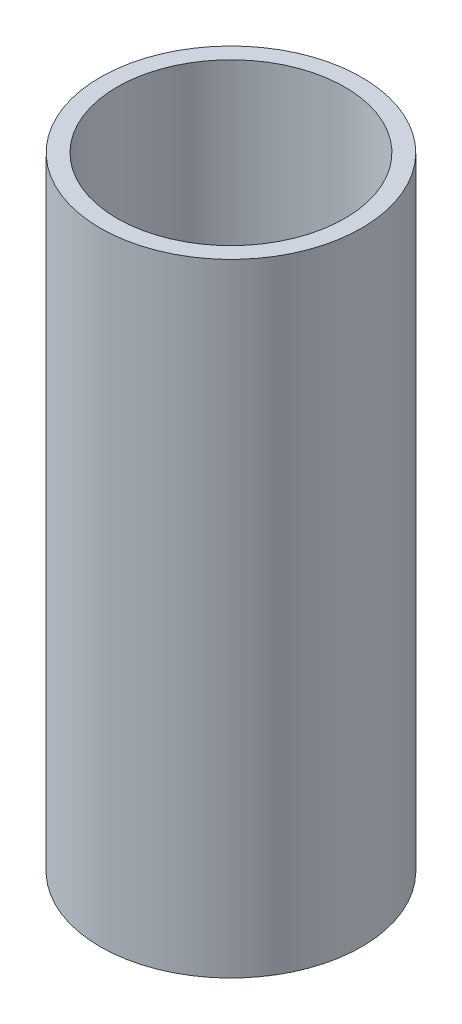
ISO-10303-21;
HEADER;
FILE_DESCRIPTION(('STEP AP214'),'2;1');
FILE_NAME('part.step','',(''),(''),'','','');
FILE_SCHEMA(('AUTOMOTIVE_DESIGN { 1 0 10303 214 1 1 1 1 }'));
ENDSEC;
DATA;
#1=APPLICATION_CONTEXT('core data for automotive mechanical design processes');
#2=APPLICATION_PROTOCOL_DEFINITION('international standard','automotive_design',2000,#1);
#3=PRODUCT_CONTEXT('',#1,'mechanical');
#4=PRODUCT('Part','Part','',(#3));
#5=PRODUCT_RELATED_PRODUCT_CATEGORY('part','',(#4));
#6=PRODUCT_DEFINITION_FORMATION('','',#4);
#7=PRODUCT_DEFINITION_CONTEXT('part definition',#1,'design');
#8=PRODUCT_DEFINITION('design','',#6,#7);
#9=PRODUCT_DEFINITION_SHAPE('','',#8);
#10=(LENGTH_UNIT() NAMED_UNIT(*) SI_UNIT(.MILLI.,.METRE.));
#11=(NAMED_UNIT(*) PLANE_ANGLE_UNIT() SI_UNIT($,.RADIAN.));
#12=(NAMED_UNIT(*) SI_UNIT($,.STERADIAN.) SOLID_ANGLE_UNIT());
#13=UNCERTAINTY_MEASURE_WITH_UNIT(LENGTH_MEASURE(1.E-05),#10,'distance_accuracy_value','');
#14=(GEOMETRIC_REPRESENTATION_CONTEXT(3) GLOBAL_UNCERTAINTY_ASSIGNED_CONTEXT((#13)) GLOBAL_UNIT_ASSIGNED_CONTEXT((#10,
#11,#12)) REPRESENTATION_CONTEXT('',''));
#15=CARTESIAN_POINT('',(0.,0.,0.));
#16=DIRECTION('',(0.,0.,1.));
#17=DIRECTION('',(1.,0.,0.));
#18=AXIS2_PLACEMENT_3D('',#15,#16,#17);
#19=CARTESIAN_POINT('',(0.,50.,0.));
#20=DIRECTION('',(0.,1.,0.));
#21=DIRECTION('',(0.,0.,1.));
#22=AXIS2_PLACEMENT_3D('',#19,#20,#21);
#23=PLANE('',#22);
#24=CARTESIAN_POINT('',(0.,50.,0.));
#25=DIRECTION('',(0.,1.,0.));
#26=DIRECTION('',(0.,0.,1.));
#27=AXIS2_PLACEMENT_3D('',#24,#25,#26);
#28=CIRCLE('',#27,10.5);
#29=CARTESIAN_POINT('',(0.,50.,10.5));
#30=VERTEX_POINT('',#29);
#31=EDGE_CURVE('E10',#30,#30,#28,.T.);
#32=ORIENTED_EDGE('',*,*,#31,.T.);
#33=EDGE_LOOP('',(#32));
#34=FACE_BOUND('',#33,.T.);
#35=CARTESIAN_POINT('',(0.,50.,0.));
#36=DIRECTION('',(0.,1.,0.));
#37=DIRECTION('',(0.,0.,1.));
#38=AXIS2_PLACEMENT_3D('',#35,#36,#37);
#39=CIRCLE('',#38,9.14661004148478);
#40=CARTESIAN_POINT('',(0.,50.,9.14661004148478));
#41=VERTEX_POINT('',#40);
#42=EDGE_CURVE('E50',#41,#41,#39,.T.);
#43=ORIENTED_EDGE('',*,*,#42,.F.);
#44=EDGE_LOOP('',(#43));
#45=FACE_BOUND('',#44,.T.);
#46=ADVANCED_FACE('F37',(#34,#45),#23,.T.);
#47=CARTESIAN_POINT('',(0.,0.,0.));
#48=DIRECTION('',(0.,1.,0.));
#49=DIRECTION('',(0.,0.,1.));
#50=AXIS2_PLACEMENT_3D('',#47,#48,#49);
#51=PLANE('',#50);
#52=CARTESIAN_POINT('',(0.,0.,0.));
#53=DIRECTION('',(0.,1.,0.));
#54=DIRECTION('',(0.,0.,1.));
#55=AXIS2_PLACEMENT_3D('',#52,#53,#54);
#56=CIRCLE('',#55,10.5);
#57=CARTESIAN_POINT('',(0.,0.,10.5));
#58=VERTEX_POINT('',#57);
#59=EDGE_CURVE('E41',#58,#58,#56,.T.);
#60=ORIENTED_EDGE('',*,*,#59,.F.);
#61=EDGE_LOOP('',(#60));
#62=FACE_BOUND('',#61,.T.);
#63=CARTESIAN_POINT('',(0.,0.,0.));
#64=DIRECTION('',(0.,1.,0.));
#65=DIRECTION('',(0.,0.,1.));
#66=AXIS2_PLACEMENT_3D('',#63,#64,#65);
#67=CIRCLE('',#66,9.14661004148478);
#68=CARTESIAN_POINT('',(0.,0.,9.14661004148478));
#69=VERTEX_POINT('',#68);
#70=EDGE_CURVE('E52',#69,#69,#67,.T.);
#71=ORIENTED_EDGE('',*,*,#70,.T.);
#72=EDGE_LOOP('',(#71));
#73=FACE_BOUND('',#72,.T.);
#74=ADVANCED_FACE('F64',(#62,#73),#51,.F.);
#75=CARTESIAN_POINT('',(0.,50.,0.));
#76=DIRECTION('',(0.,-1.,0.));
#77=DIRECTION('',(0.,0.,-1.));
#78=AXIS2_PLACEMENT_3D('',#75,#76,#77);
#79=CYLINDRICAL_SURFACE('',#78,10.5);
#80=ORIENTED_EDGE('',*,*,#31,.F.);
#81=EDGE_LOOP('',(#80));
#82=FACE_BOUND('',#81,.T.);
#83=ORIENTED_EDGE('',*,*,#59,.T.);
#84=EDGE_LOOP('',(#83));
#85=FACE_BOUND('',#84,.T.);
#86=ADVANCED_FACE('F39',(#82,#85),#79,.T.);
#87=CARTESIAN_POINT('',(0.,50.,0.));
#88=DIRECTION('',(0.,-1.,0.));
#89=DIRECTION('',(0.,0.,-1.));
#90=AXIS2_PLACEMENT_3D('',#87,#88,#89);
#91=CYLINDRICAL_SURFACE('',#90,9.14661004148478);
#92=ORIENTED_EDGE('',*,*,#42,.T.);
#93=EDGE_LOOP('',(#92));
#94=FACE_BOUND('',#93,.T.);
#95=ORIENTED_EDGE('',*,*,#70,.F.);
#96=EDGE_LOOP('',(#95));
#97=FACE_BOUND('',#96,.T.);
#98=ADVANCED_FACE('F60',(#94,#97),#91,.F.);
#99=CLOSED_SHELL('',(#46,#74,#86,#98));
#100=MANIFOLD_SOLID_BREP('B2',#99);
#101=ADVANCED_BREP_SHAPE_REPRESENTATION('',(#18,#100),#14);
#102=SHAPE_DEFINITION_REPRESENTATION(#9,#101);
ENDSEC;
END-ISO-10303-21;
